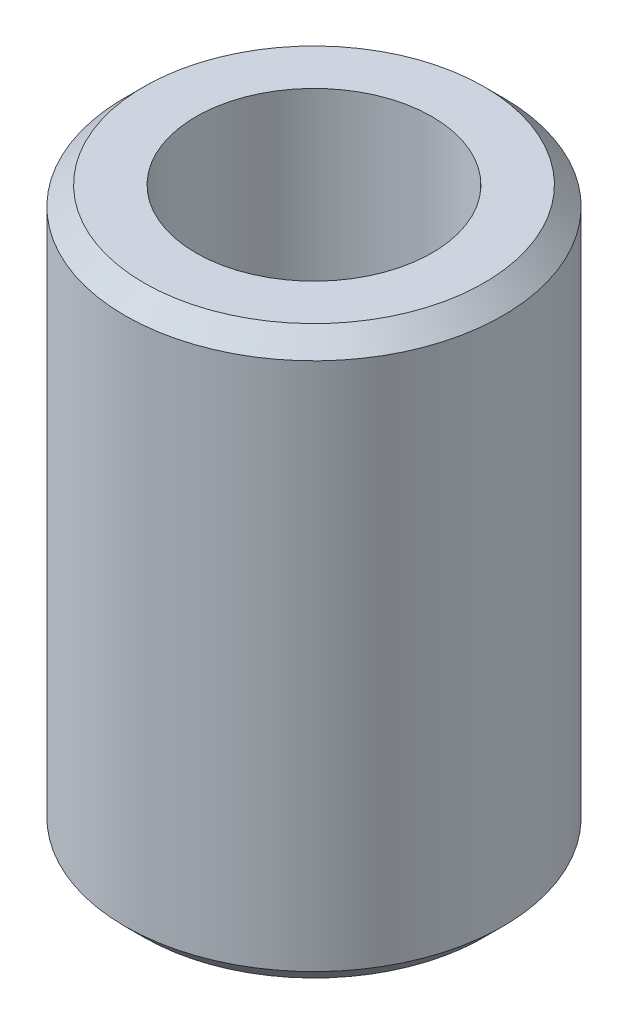
ISO-10303-21;
HEADER;
FILE_DESCRIPTION(('STEP AP214'),'2;1');
FILE_NAME('part.step','',(''),(''),'','','');
FILE_SCHEMA(('AUTOMOTIVE_DESIGN { 1 0 10303 214 1 1 1 1 }'));
ENDSEC;
DATA;
#1=APPLICATION_CONTEXT('core data for automotive mechanical design processes');
#2=APPLICATION_PROTOCOL_DEFINITION('international standard','automotive_design',2000,#1);
#3=PRODUCT_CONTEXT('',#1,'mechanical');
#4=PRODUCT('Part','Part','',(#3));
#5=PRODUCT_RELATED_PRODUCT_CATEGORY('part','',(#4));
#6=PRODUCT_DEFINITION_FORMATION('','',#4);
#7=PRODUCT_DEFINITION_CONTEXT('part definition',#1,'design');
#8=PRODUCT_DEFINITION('design','',#6,#7);
#9=PRODUCT_DEFINITION_SHAPE('','',#8);
#10=(LENGTH_UNIT() NAMED_UNIT(*) SI_UNIT(.MILLI.,.METRE.));
#11=(NAMED_UNIT(*) PLANE_ANGLE_UNIT() SI_UNIT($,.RADIAN.));
#12=(NAMED_UNIT(*) SI_UNIT($,.STERADIAN.) SOLID_ANGLE_UNIT());
#13=UNCERTAINTY_MEASURE_WITH_UNIT(LENGTH_MEASURE(1.E-05),#10,'distance_accuracy_value','');
#14=(GEOMETRIC_REPRESENTATION_CONTEXT(3) GLOBAL_UNCERTAINTY_ASSIGNED_CONTEXT((#13)) GLOBAL_UNIT_ASSIGNED_CONTEXT((#10,
#11,#12)) REPRESENTATION_CONTEXT('',''));
#15=CARTESIAN_POINT('',(0.,0.,0.));
#16=DIRECTION('',(0.,0.,1.));
#17=DIRECTION('',(1.,0.,0.));
#18=AXIS2_PLACEMENT_3D('',#15,#16,#17);
#19=CARTESIAN_POINT('',(0.,30.,0.));
#20=DIRECTION('',(0.,1.,0.));
#21=DIRECTION('',(0.,0.,1.));
#22=AXIS2_PLACEMENT_3D('',#19,#20,#21);
#23=PLANE('',#22);
#24=CARTESIAN_POINT('',(0.,30.,0.));
#25=DIRECTION('',(0.,1.,0.));
#26=DIRECTION('',(0.,0.,1.));
#27=AXIS2_PLACEMENT_3D('',#24,#25,#26);
#28=CIRCLE('',#27,18.);
#29=CARTESIAN_POINT('',(0.,30.,18.));
#30=VERTEX_POINT('',#29);
#31=EDGE_CURVE('E10',#30,#30,#28,.T.);
#32=ORIENTED_EDGE('',*,*,#31,.T.);
#33=EDGE_LOOP('',(#32));
#34=FACE_BOUND('',#33,.T.);
#35=CARTESIAN_POINT('',(0.,30.,0.));
#36=DIRECTION('',(0.,1.,0.));
#37=DIRECTION('',(0.,0.,1.));
#38=AXIS2_PLACEMENT_3D('',#35,#36,#37);
#39=CIRCLE('',#38,12.5);
#40=CARTESIAN_POINT('',(0.,30.,12.5));
#41=VERTEX_POINT('',#40);
#42=EDGE_CURVE('E51',#41,#41,#39,.T.);
#43=ORIENTED_EDGE('',*,*,#42,.F.);
#44=EDGE_LOOP('',(#43));
#45=FACE_BOUND('',#44,.T.);
#46=ADVANCED_FACE('F31',(#34,#45),#23,.T.);
#47=CARTESIAN_POINT('',(0.,-30.,0.));
#48=DIRECTION('',(0.,1.,0.));
#49=DIRECTION('',(0.,0.,1.));
#50=AXIS2_PLACEMENT_3D('',#47,#48,#49);
#51=PLANE('',#50);
#52=CARTESIAN_POINT('',(0.,-30.,0.));
#53=DIRECTION('',(0.,1.,0.));
#54=DIRECTION('',(0.,0.,1.));
#55=AXIS2_PLACEMENT_3D('',#52,#53,#54);
#56=CIRCLE('',#55,18.);
#57=CARTESIAN_POINT('',(0.,-30.,18.));
#58=VERTEX_POINT('',#57);
#59=EDGE_CURVE('E38',#58,#58,#56,.F.);
#60=ORIENTED_EDGE('',*,*,#59,.T.);
#61=EDGE_LOOP('',(#60));
#62=FACE_BOUND('',#61,.T.);
#63=CARTESIAN_POINT('',(0.,-30.,0.));
#64=DIRECTION('',(0.,1.,0.));
#65=DIRECTION('',(0.,0.,1.));
#66=AXIS2_PLACEMENT_3D('',#63,#64,#65);
#67=CIRCLE('',#66,12.5);
#68=CARTESIAN_POINT('',(0.,-30.,12.5));
#69=VERTEX_POINT('',#68);
#70=EDGE_CURVE('E52',#69,#69,#67,.T.);
#71=ORIENTED_EDGE('',*,*,#70,.T.);
#72=EDGE_LOOP('',(#71));
#73=FACE_BOUND('',#72,.T.);
#74=ADVANCED_FACE('F62',(#62,#73),#51,.F.);
#75=CARTESIAN_POINT('',(0.,30.,0.));
#76=DIRECTION('',(0.,-1.,0.));
#77=DIRECTION('',(0.,0.,-1.));
#78=AXIS2_PLACEMENT_3D('',#75,#76,#77);
#79=CYLINDRICAL_SURFACE('',#78,20.);
#80=CARTESIAN_POINT('',(0.,-28.,0.));
#81=DIRECTION('',(0.,1.,0.));
#82=DIRECTION('',(0.,0.,1.));
#83=AXIS2_PLACEMENT_3D('',#80,#81,#82);
#84=CIRCLE('',#83,20.);
#85=CARTESIAN_POINT('',(0.,-28.,20.));
#86=VERTEX_POINT('',#85);
#87=EDGE_CURVE('E42',#86,#86,#84,.T.);
#88=ORIENTED_EDGE('',*,*,#87,.T.);
#89=EDGE_LOOP('',(#88));
#90=FACE_BOUND('',#89,.T.);
#91=CARTESIAN_POINT('',(0.,28.,0.));
#92=DIRECTION('',(0.,1.,0.));
#93=DIRECTION('',(0.,0.,1.));
#94=AXIS2_PLACEMENT_3D('',#91,#92,#93);
#95=CIRCLE('',#94,20.);
#96=CARTESIAN_POINT('',(0.,28.,20.));
#97=VERTEX_POINT('',#96);
#98=EDGE_CURVE('E46',#97,#97,#95,.F.);
#99=ORIENTED_EDGE('',*,*,#98,.T.);
#100=EDGE_LOOP('',(#99));
#101=FACE_BOUND('',#100,.T.);
#102=ADVANCED_FACE('F67',(#90,#101),#79,.T.);
#103=CARTESIAN_POINT('',(0.,30.,0.));
#104=DIRECTION('',(0.,-1.,0.));
#105=DIRECTION('',(0.,0.,-1.));
#106=AXIS2_PLACEMENT_3D('',#103,#104,#105);
#107=CYLINDRICAL_SURFACE('',#106,12.5);
#108=ORIENTED_EDGE('',*,*,#42,.T.);
#109=EDGE_LOOP('',(#108));
#110=FACE_BOUND('',#109,.T.);
#111=ORIENTED_EDGE('',*,*,#70,.F.);
#112=EDGE_LOOP('',(#111));
#113=FACE_BOUND('',#112,.T.);
#114=ADVANCED_FACE('F58',(#110,#113),#107,.F.);
#115=CARTESIAN_POINT('',(0.,-28.,0.));
#116=DIRECTION('',(0.,1.,0.));
#117=DIRECTION('',(0.,0.,1.));
#118=AXIS2_PLACEMENT_3D('',#115,#116,#117);
#119=CONICAL_SURFACE('',#118,20.,0.785398163397451);
#120=ORIENTED_EDGE('',*,*,#59,.F.);
#121=EDGE_LOOP('',(#120));
#122=FACE_BOUND('',#121,.T.);
#123=ORIENTED_EDGE('',*,*,#87,.F.);
#124=EDGE_LOOP('',(#123));
#125=FACE_BOUND('',#124,.T.);
#126=ADVANCED_FACE('F73',(#122,#125),#119,.T.);
#127=CARTESIAN_POINT('',(0.,30.,0.));
#128=DIRECTION('',(0.,-1.,0.));
#129=DIRECTION('',(0.,0.,-1.));
#130=AXIS2_PLACEMENT_3D('',#127,#128,#129);
#131=CONICAL_SURFACE('',#130,18.,0.785398163397448);
#132=ORIENTED_EDGE('',*,*,#98,.F.);
#133=EDGE_LOOP('',(#132));
#134=FACE_BOUND('',#133,.T.);
#135=ORIENTED_EDGE('',*,*,#31,.F.);
#136=EDGE_LOOP('',(#135));
#137=FACE_BOUND('',#136,.T.);
#138=ADVANCED_FACE('F33',(#134,#137),#131,.T.);
#139=CLOSED_SHELL('',(#46,#74,#102,#114,#126,#138));
#140=MANIFOLD_SOLID_BREP('B2',#139);
#141=ADVANCED_BREP_SHAPE_REPRESENTATION('',(#18,#140),#14);
#142=SHAPE_DEFINITION_REPRESENTATION(#9,#141);
ENDSEC;
END-ISO-10303-21;
